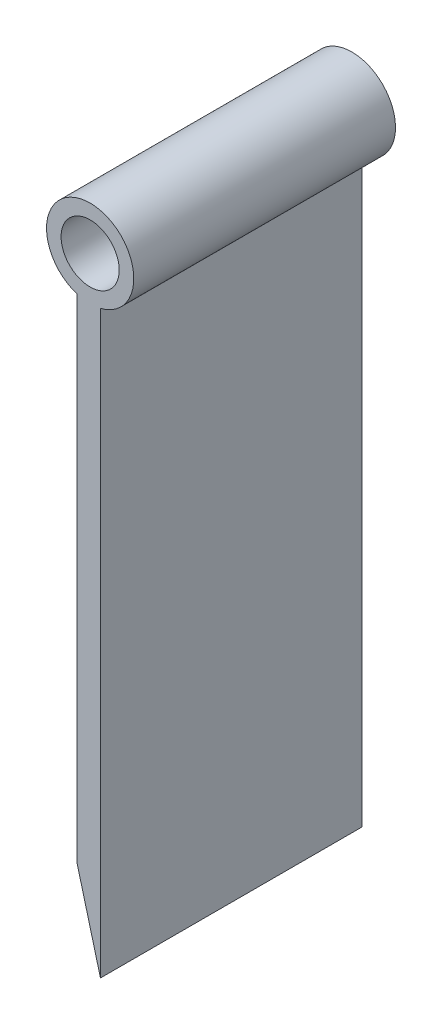
ISO-10303-21;
HEADER;
FILE_DESCRIPTION(('STEP AP214'),'2;1');
FILE_NAME('part.step','',(''),(''),'','','');
FILE_SCHEMA(('AUTOMOTIVE_DESIGN { 1 0 10303 214 1 1 1 1 }'));
ENDSEC;
DATA;
#1=APPLICATION_CONTEXT('core data for automotive mechanical design processes');
#2=APPLICATION_PROTOCOL_DEFINITION('international standard','automotive_design',2000,#1);
#3=PRODUCT_CONTEXT('',#1,'mechanical');
#4=PRODUCT('Part','Part','',(#3));
#5=PRODUCT_RELATED_PRODUCT_CATEGORY('part','',(#4));
#6=PRODUCT_DEFINITION_FORMATION('','',#4);
#7=PRODUCT_DEFINITION_CONTEXT('part definition',#1,'design');
#8=PRODUCT_DEFINITION('design','',#6,#7);
#9=PRODUCT_DEFINITION_SHAPE('','',#8);
#10=(LENGTH_UNIT() NAMED_UNIT(*) SI_UNIT(.MILLI.,.METRE.));
#11=(NAMED_UNIT(*) PLANE_ANGLE_UNIT() SI_UNIT($,.RADIAN.));
#12=(NAMED_UNIT(*) SI_UNIT($,.STERADIAN.) SOLID_ANGLE_UNIT());
#13=UNCERTAINTY_MEASURE_WITH_UNIT(LENGTH_MEASURE(1.E-05),#10,'distance_accuracy_value','');
#14=(GEOMETRIC_REPRESENTATION_CONTEXT(3) GLOBAL_UNCERTAINTY_ASSIGNED_CONTEXT((#13)) GLOBAL_UNIT_ASSIGNED_CONTEXT((#10,
#11,#12)) REPRESENTATION_CONTEXT('',''));
#15=CARTESIAN_POINT('',(0.,0.,0.));
#16=DIRECTION('',(0.,0.,1.));
#17=DIRECTION('',(1.,0.,0.));
#18=AXIS2_PLACEMENT_3D('',#15,#16,#17);
#19=CARTESIAN_POINT('',(-0.886438093421773,53.5,22.5));
#20=DIRECTION('',(0.,0.,1.));
#21=DIRECTION('',(1.,0.,0.));
#22=AXIS2_PLACEMENT_3D('',#19,#20,#21);
#23=PLANE('',#22);
#24=DIRECTION('',(0.257662650560332,-0.966234939601246,0.));
#25=VECTOR('',#24,1.);
#26=CARTESIAN_POINT('',(-1.99999999999999,7.5,22.5));
#27=LINE('',#26,#25);
#28=CARTESIAN_POINT('',(-1.99999999999999,7.5,22.5));
#29=VERTEX_POINT('',#28);
#30=CARTESIAN_POINT('',(0.,0.,22.5));
#31=VERTEX_POINT('',#30);
#32=EDGE_CURVE('E85',#29,#31,#27,.T.);
#33=ORIENTED_EDGE('',*,*,#32,.T.);
#34=DIRECTION('',(0.,1.,0.));
#35=VECTOR('',#34,1.);
#36=CARTESIAN_POINT('',(0.,0.,22.5));
#37=LINE('',#36,#35);
#38=CARTESIAN_POINT('',(0.,49.8562755995368,22.5));
#39=VERTEX_POINT('',#38);
#40=EDGE_CURVE('E80',#31,#39,#37,.T.);
#41=ORIENTED_EDGE('',*,*,#40,.T.);
#42=CARTESIAN_POINT('',(-0.886438093421773,53.5,22.5));
#43=DIRECTION('',(0.,0.,1.));
#44=DIRECTION('',(1.,0.,0.));
#45=AXIS2_PLACEMENT_3D('',#42,#43,#44);
#46=CIRCLE('',#45,3.75);
#47=CARTESIAN_POINT('',(-2.,49.9191509553993,22.5));
#48=VERTEX_POINT('',#47);
#49=EDGE_CURVE('E83',#39,#48,#46,.T.);
#50=ORIENTED_EDGE('',*,*,#49,.T.);
#51=DIRECTION('',(0.,-1.,0.));
#52=VECTOR('',#51,1.);
#53=CARTESIAN_POINT('',(-2.,49.9191509553993,22.5));
#54=LINE('',#53,#52);
#55=EDGE_CURVE('E50',#48,#29,#54,.T.);
#56=ORIENTED_EDGE('',*,*,#55,.T.);
#57=EDGE_LOOP('',(#33,#41,#50,#56));
#58=FACE_BOUND('',#57,.T.);
#59=CARTESIAN_POINT('',(-0.886438093421773,53.5,22.5));
#60=DIRECTION('',(0.,0.,1.));
#61=DIRECTION('',(1.,0.,0.));
#62=AXIS2_PLACEMENT_3D('',#59,#60,#61);
#63=CIRCLE('',#62,2.5);
#64=CARTESIAN_POINT('',(1.61356190657823,53.5,22.5));
#65=VERTEX_POINT('',#64);
#66=EDGE_CURVE('E100',#65,#65,#63,.T.);
#67=ORIENTED_EDGE('',*,*,#66,.F.);
#68=EDGE_LOOP('',(#67));
#69=FACE_BOUND('',#68,.T.);
#70=ADVANCED_FACE('F33',(#58,#69),#23,.T.);
#71=CARTESIAN_POINT('',(-0.886438093421773,53.5,0.));
#72=DIRECTION('',(0.,0.,1.));
#73=DIRECTION('',(1.,0.,0.));
#74=AXIS2_PLACEMENT_3D('',#71,#72,#73);
#75=PLANE('',#74);
#76=DIRECTION('',(0.257662650560332,-0.966234939601246,0.));
#77=VECTOR('',#76,1.);
#78=CARTESIAN_POINT('',(-1.99999999999999,7.5,0.));
#79=LINE('',#78,#77);
#80=CARTESIAN_POINT('',(-1.99999999999999,7.5,0.));
#81=VERTEX_POINT('',#80);
#82=CARTESIAN_POINT('',(0.,0.,0.));
#83=VERTEX_POINT('',#82);
#84=EDGE_CURVE('E97',#81,#83,#79,.T.);
#85=ORIENTED_EDGE('',*,*,#84,.F.);
#86=DIRECTION('',(0.,-1.,0.));
#87=VECTOR('',#86,1.);
#88=CARTESIAN_POINT('',(-2.,49.9191509553993,0.));
#89=LINE('',#88,#87);
#90=CARTESIAN_POINT('',(-2.,49.9191509553993,0.));
#91=VERTEX_POINT('',#90);
#92=EDGE_CURVE('E73',#91,#81,#89,.T.);
#93=ORIENTED_EDGE('',*,*,#92,.F.);
#94=CARTESIAN_POINT('',(-0.886438093421773,53.5,0.));
#95=DIRECTION('',(0.,0.,1.));
#96=DIRECTION('',(1.,0.,0.));
#97=AXIS2_PLACEMENT_3D('',#94,#95,#96);
#98=CIRCLE('',#97,3.75);
#99=CARTESIAN_POINT('',(0.,49.8562755995368,0.));
#100=VERTEX_POINT('',#99);
#101=EDGE_CURVE('E67',#100,#91,#98,.T.);
#102=ORIENTED_EDGE('',*,*,#101,.F.);
#103=DIRECTION('',(0.,1.,0.));
#104=VECTOR('',#103,1.);
#105=CARTESIAN_POINT('',(0.,0.,0.));
#106=LINE('',#105,#104);
#107=EDGE_CURVE('E89',#83,#100,#106,.T.);
#108=ORIENTED_EDGE('',*,*,#107,.F.);
#109=EDGE_LOOP('',(#85,#93,#102,#108));
#110=FACE_BOUND('',#109,.T.);
#111=CARTESIAN_POINT('',(-0.886438093421773,53.5,0.));
#112=DIRECTION('',(0.,0.,1.));
#113=DIRECTION('',(1.,0.,0.));
#114=AXIS2_PLACEMENT_3D('',#111,#112,#113);
#115=CIRCLE('',#114,2.5);
#116=CARTESIAN_POINT('',(1.61356190657823,53.5,0.));
#117=VERTEX_POINT('',#116);
#118=EDGE_CURVE('E112',#117,#117,#115,.T.);
#119=ORIENTED_EDGE('',*,*,#118,.T.);
#120=EDGE_LOOP('',(#119));
#121=FACE_BOUND('',#120,.T.);
#122=ADVANCED_FACE('F108',(#110,#121),#75,.F.);
#123=CARTESIAN_POINT('',(-1.99999999999999,7.5,22.5));
#124=DIRECTION('',(0.966234939601246,0.257662650560332,0.));
#125=DIRECTION('',(-0.257662650560332,0.966234939601247,0.));
#126=AXIS2_PLACEMENT_3D('',#123,#124,#125);
#127=PLANE('',#126);
#128=ORIENTED_EDGE('',*,*,#84,.T.);
#129=DIRECTION('',(0.,0.,-1.));
#130=VECTOR('',#129,1.);
#131=CARTESIAN_POINT('',(0.,0.,22.5));
#132=LINE('',#131,#130);
#133=EDGE_CURVE('E11',#31,#83,#132,.T.);
#134=ORIENTED_EDGE('',*,*,#133,.F.);
#135=ORIENTED_EDGE('',*,*,#32,.F.);
#136=DIRECTION('',(0.,0.,-1.));
#137=VECTOR('',#136,1.);
#138=CARTESIAN_POINT('',(-1.99999999999999,7.5,22.5));
#139=LINE('',#138,#137);
#140=EDGE_CURVE('E93',#29,#81,#139,.T.);
#141=ORIENTED_EDGE('',*,*,#140,.T.);
#142=EDGE_LOOP('',(#128,#134,#135,#141));
#143=FACE_BOUND('',#142,.T.);
#144=ADVANCED_FACE('F35',(#143),#127,.F.);
#145=CARTESIAN_POINT('',(0.,0.,22.5));
#146=DIRECTION('',(-1.,0.,0.));
#147=DIRECTION('',(0.,0.,1.));
#148=AXIS2_PLACEMENT_3D('',#145,#146,#147);
#149=PLANE('',#148);
#150=ORIENTED_EDGE('',*,*,#107,.T.);
#151=DIRECTION('',(0.,0.,-1.));
#152=VECTOR('',#151,1.);
#153=CARTESIAN_POINT('',(0.,49.8562755995368,22.5));
#154=LINE('',#153,#152);
#155=EDGE_CURVE('E42',#39,#100,#154,.T.);
#156=ORIENTED_EDGE('',*,*,#155,.F.);
#157=ORIENTED_EDGE('',*,*,#40,.F.);
#158=ORIENTED_EDGE('',*,*,#133,.T.);
#159=EDGE_LOOP('',(#150,#156,#157,#158));
#160=FACE_BOUND('',#159,.T.);
#161=ADVANCED_FACE('F88',(#160),#149,.F.);
#162=CARTESIAN_POINT('',(-0.886438093421773,53.5,22.5));
#163=DIRECTION('',(0.,0.,-1.));
#164=DIRECTION('',(-1.,0.,0.));
#165=AXIS2_PLACEMENT_3D('',#162,#163,#164);
#166=CYLINDRICAL_SURFACE('',#165,3.75);
#167=ORIENTED_EDGE('',*,*,#101,.T.);
#168=DIRECTION('',(0.,0.,-1.));
#169=VECTOR('',#168,1.);
#170=CARTESIAN_POINT('',(-2.,49.9191509553993,22.5));
#171=LINE('',#170,#169);
#172=EDGE_CURVE('E90',#48,#91,#171,.T.);
#173=ORIENTED_EDGE('',*,*,#172,.F.);
#174=ORIENTED_EDGE('',*,*,#49,.F.);
#175=ORIENTED_EDGE('',*,*,#155,.T.);
#176=EDGE_LOOP('',(#167,#173,#174,#175));
#177=FACE_BOUND('',#176,.T.);
#178=ADVANCED_FACE('F91',(#177),#166,.T.);
#179=CARTESIAN_POINT('',(-2.,49.9191509553993,22.5));
#180=DIRECTION('',(1.,0.,0.));
#181=DIRECTION('',(0.,1.,0.));
#182=AXIS2_PLACEMENT_3D('',#179,#180,#181);
#183=PLANE('',#182);
#184=ORIENTED_EDGE('',*,*,#92,.T.);
#185=ORIENTED_EDGE('',*,*,#140,.F.);
#186=ORIENTED_EDGE('',*,*,#55,.F.);
#187=ORIENTED_EDGE('',*,*,#172,.T.);
#188=EDGE_LOOP('',(#184,#185,#186,#187));
#189=FACE_BOUND('',#188,.T.);
#190=ADVANCED_FACE('F105',(#189),#183,.F.);
#191=CARTESIAN_POINT('',(-0.886438093421773,53.5,22.5));
#192=DIRECTION('',(0.,0.,-1.));
#193=DIRECTION('',(-1.,0.,0.));
#194=AXIS2_PLACEMENT_3D('',#191,#192,#193);
#195=CYLINDRICAL_SURFACE('',#194,2.5);
#196=ORIENTED_EDGE('',*,*,#66,.T.);
#197=EDGE_LOOP('',(#196));
#198=FACE_BOUND('',#197,.T.);
#199=ORIENTED_EDGE('',*,*,#118,.F.);
#200=EDGE_LOOP('',(#199));
#201=FACE_BOUND('',#200,.T.);
#202=ADVANCED_FACE('F118',(#198,#201),#195,.F.);
#203=CLOSED_SHELL('',(#70,#122,#144,#161,#178,#190,#202));
#204=MANIFOLD_SOLID_BREP('B2',#203);
#205=ADVANCED_BREP_SHAPE_REPRESENTATION('',(#18,#204),#14);
#206=SHAPE_DEFINITION_REPRESENTATION(#9,#205);
ENDSEC;
END-ISO-10303-21;
